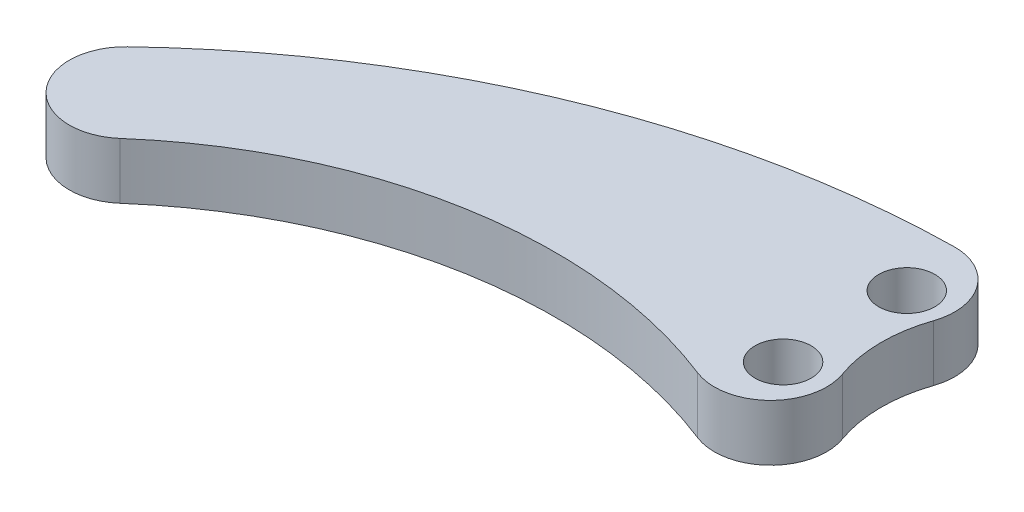
ISO-10303-21;
HEADER;
FILE_DESCRIPTION(('STEP AP214'),'2;1');
FILE_NAME('part.step','',(''),(''),'','','');
FILE_SCHEMA(('AUTOMOTIVE_DESIGN { 1 0 10303 214 1 1 1 1 }'));
ENDSEC;
DATA;
#1=APPLICATION_CONTEXT('core data for automotive mechanical design processes');
#2=APPLICATION_PROTOCOL_DEFINITION('international standard','automotive_design',2000,#1);
#3=PRODUCT_CONTEXT('',#1,'mechanical');
#4=PRODUCT('Part','Part','',(#3));
#5=PRODUCT_RELATED_PRODUCT_CATEGORY('part','',(#4));
#6=PRODUCT_DEFINITION_FORMATION('','',#4);
#7=PRODUCT_DEFINITION_CONTEXT('part definition',#1,'design');
#8=PRODUCT_DEFINITION('design','',#6,#7);
#9=PRODUCT_DEFINITION_SHAPE('','',#8);
#10=(LENGTH_UNIT() NAMED_UNIT(*) SI_UNIT(.MILLI.,.METRE.));
#11=(NAMED_UNIT(*) PLANE_ANGLE_UNIT() SI_UNIT($,.RADIAN.));
#12=(NAMED_UNIT(*) SI_UNIT($,.STERADIAN.) SOLID_ANGLE_UNIT());
#13=UNCERTAINTY_MEASURE_WITH_UNIT(LENGTH_MEASURE(1.E-05),#10,'distance_accuracy_value','');
#14=(GEOMETRIC_REPRESENTATION_CONTEXT(3) GLOBAL_UNCERTAINTY_ASSIGNED_CONTEXT((#13)) GLOBAL_UNIT_ASSIGNED_CONTEXT((#10,
#11,#12)) REPRESENTATION_CONTEXT('',''));
#15=CARTESIAN_POINT('',(0.,0.,0.));
#16=DIRECTION('',(0.,0.,1.));
#17=DIRECTION('',(1.,0.,0.));
#18=AXIS2_PLACEMENT_3D('',#15,#16,#17);
#19=CARTESIAN_POINT('',(-68.570576814493,10.,52.8858262317222));
#20=DIRECTION('',(0.,1.,0.));
#21=DIRECTION('',(0.,0.,1.));
#22=AXIS2_PLACEMENT_3D('',#19,#20,#21);
#23=PLANE('',#22);
#24=CARTESIAN_POINT('',(0.,10.,-22.));
#25=DIRECTION('',(0.,1.,0.));
#26=DIRECTION('',(0.,0.,1.));
#27=AXIS2_PLACEMENT_3D('',#24,#25,#26);
#28=CIRCLE('',#27,5.);
#29=CARTESIAN_POINT('',(0.,10.,-17.));
#30=VERTEX_POINT('',#29);
#31=EDGE_CURVE('E180',#30,#30,#28,.T.);
#32=ORIENTED_EDGE('',*,*,#31,.F.);
#33=EDGE_LOOP('',(#32));
#34=FACE_BOUND('',#33,.T.);
#35=CARTESIAN_POINT('',(-37.1411536289861,10.,88.7716524634445));
#36=DIRECTION('',(0.,-1.,0.));
#37=DIRECTION('',(0.,0.,-1.));
#38=AXIS2_PLACEMENT_3D('',#35,#36,#37);
#39=CIRCLE('',#38,85.4065231754527);
#40=CARTESIAN_POINT('',(-93.4114728973598,10.,24.522719629082));
#41=VERTEX_POINT('',#40);
#42=CARTESIAN_POINT('',(-5.92305827580545,10.,9.27508194974962));
#43=VERTEX_POINT('',#42);
#44=EDGE_CURVE('E129',#41,#43,#39,.T.);
#45=ORIENTED_EDGE('',*,*,#44,.T.);
#46=CARTESIAN_POINT('',(-2.26782279817705,10.,-0.0329389786264418));
#47=DIRECTION('',(0.,1.,0.));
#48=DIRECTION('',(0.,0.,1.));
#49=AXIS2_PLACEMENT_3D('',#46,#47,#48);
#50=CIRCLE('',#49,10.);
#51=CARTESIAN_POINT('',(7.14785483890656,10.,-3.40117510967836));
#52=VERTEX_POINT('',#51);
#53=EDGE_CURVE('E83',#43,#52,#50,.T.);
#54=ORIENTED_EDGE('',*,*,#53,.T.);
#55=CARTESIAN_POINT('',(30.5035185393833,10.,-11.7561117773072));
#56=DIRECTION('',(0.,-1.,0.));
#57=DIRECTION('',(0.,0.,-1.));
#58=AXIS2_PLACEMENT_3D('',#55,#56,#57);
#59=CIRCLE('',#58,24.8050799960382);
#60=CARTESIAN_POINT('',(7.02346655755829,10.,-19.7548087049731));
#61=VERTEX_POINT('',#60);
#62=EDGE_CURVE('E136',#52,#61,#59,.T.);
#63=ORIENTED_EDGE('',*,*,#62,.T.);
#64=CARTESIAN_POINT('',(-2.4423573726912,10.,-22.9794291976074));
#65=DIRECTION('',(0.,1.,0.));
#66=DIRECTION('',(0.,0.,1.));
#67=AXIS2_PLACEMENT_3D('',#64,#65,#66);
#68=CIRCLE('',#67,10.);
#69=CARTESIAN_POINT('',(-2.61079581218706,10.,-32.9780105215804));
#70=VERTEX_POINT('',#69);
#71=EDGE_CURVE('E90',#61,#70,#68,.T.);
#72=ORIENTED_EDGE('',*,*,#71,.T.);
#73=CARTESIAN_POINT('',(2.84494650060196E-13,10.,122.000000000001));
#74=DIRECTION('',(0.,-1.,0.));
#75=DIRECTION('',(0.,0.,-1.));
#76=AXIS2_PLACEMENT_3D('',#73,#74,#75);
#77=CIRCLE('',#76,155.000000000001);
#78=CARTESIAN_POINT('',(-106.896551724138,10.,9.75862068965513));
#79=VERTEX_POINT('',#78);
#80=EDGE_CURVE('E141',#79,#70,#77,.T.);
#81=ORIENTED_EDGE('',*,*,#80,.F.);
#82=CARTESIAN_POINT('',(-100.,10.,17.));
#83=DIRECTION('',(0.,1.,0.));
#84=DIRECTION('',(0.,0.,1.));
#85=AXIS2_PLACEMENT_3D('',#82,#83,#84);
#86=CIRCLE('',#85,10.);
#87=EDGE_CURVE('E137',#79,#41,#86,.T.);
#88=ORIENTED_EDGE('',*,*,#87,.T.);
#89=EDGE_LOOP('',(#45,#54,#63,#72,#81,#88));
#90=FACE_BOUND('',#89,.T.);
#91=CARTESIAN_POINT('',(0.,10.,0.));
#92=DIRECTION('',(0.,1.,0.));
#93=DIRECTION('',(0.,0.,1.));
#94=AXIS2_PLACEMENT_3D('',#91,#92,#93);
#95=CIRCLE('',#94,5.);
#96=CARTESIAN_POINT('',(0.,10.,5.));
#97=VERTEX_POINT('',#96);
#98=EDGE_CURVE('E282',#97,#97,#95,.T.);
#99=ORIENTED_EDGE('',*,*,#98,.F.);
#100=EDGE_LOOP('',(#99));
#101=FACE_BOUND('',#100,.T.);
#102=ADVANCED_FACE('F75',(#34,#90,#101),#23,.T.);
#103=CARTESIAN_POINT('',(-68.570576814493,0.,52.8858262317222));
#104=DIRECTION('',(0.,1.,0.));
#105=DIRECTION('',(0.,0.,1.));
#106=AXIS2_PLACEMENT_3D('',#103,#104,#105);
#107=PLANE('',#106);
#108=CARTESIAN_POINT('',(30.5035185393833,0.,-11.7561117773072));
#109=DIRECTION('',(0.,-1.,0.));
#110=DIRECTION('',(0.,0.,-1.));
#111=AXIS2_PLACEMENT_3D('',#108,#109,#110);
#112=CIRCLE('',#111,24.8050799960382);
#113=CARTESIAN_POINT('',(7.14785483890656,0.,-3.40117510967836));
#114=VERTEX_POINT('',#113);
#115=CARTESIAN_POINT('',(7.02346655755829,0.,-19.7548087049731));
#116=VERTEX_POINT('',#115);
#117=EDGE_CURVE('E177',#114,#116,#112,.T.);
#118=ORIENTED_EDGE('',*,*,#117,.F.);
#119=CARTESIAN_POINT('',(-2.26782279817705,0.,-0.0329389786264418));
#120=DIRECTION('',(0.,1.,0.));
#121=DIRECTION('',(0.,0.,1.));
#122=AXIS2_PLACEMENT_3D('',#119,#120,#121);
#123=CIRCLE('',#122,10.);
#124=CARTESIAN_POINT('',(-5.92305827580545,0.,9.27508194974962));
#125=VERTEX_POINT('',#124);
#126=EDGE_CURVE('E160',#114,#125,#123,.F.);
#127=ORIENTED_EDGE('',*,*,#126,.T.);
#128=CARTESIAN_POINT('',(-37.1411536289861,0.,88.7716524634445));
#129=DIRECTION('',(0.,-1.,0.));
#130=DIRECTION('',(0.,0.,-1.));
#131=AXIS2_PLACEMENT_3D('',#128,#129,#130);
#132=CIRCLE('',#131,85.4065231754527);
#133=CARTESIAN_POINT('',(-93.4114728973598,0.,24.522719629082));
#134=VERTEX_POINT('',#133);
#135=EDGE_CURVE('E176',#134,#125,#132,.T.);
#136=ORIENTED_EDGE('',*,*,#135,.F.);
#137=CARTESIAN_POINT('',(-100.,0.,17.));
#138=DIRECTION('',(0.,1.,0.));
#139=DIRECTION('',(0.,0.,1.));
#140=AXIS2_PLACEMENT_3D('',#137,#138,#139);
#141=CIRCLE('',#140,10.);
#142=CARTESIAN_POINT('',(-106.896551724138,0.,9.75862068965513));
#143=VERTEX_POINT('',#142);
#144=EDGE_CURVE('E147',#143,#134,#141,.T.);
#145=ORIENTED_EDGE('',*,*,#144,.F.);
#146=CARTESIAN_POINT('',(2.84494650060196E-13,0.,122.000000000001));
#147=DIRECTION('',(0.,-1.,0.));
#148=DIRECTION('',(0.,0.,-1.));
#149=AXIS2_PLACEMENT_3D('',#146,#147,#148);
#150=CIRCLE('',#149,155.000000000001);
#151=CARTESIAN_POINT('',(-2.61079581218706,0.,-32.9780105215804));
#152=VERTEX_POINT('',#151);
#153=EDGE_CURVE('E143',#143,#152,#150,.T.);
#154=ORIENTED_EDGE('',*,*,#153,.T.);
#155=CARTESIAN_POINT('',(-2.4423573726912,0.,-22.9794291976074));
#156=DIRECTION('',(0.,1.,0.));
#157=DIRECTION('',(0.,0.,1.));
#158=AXIS2_PLACEMENT_3D('',#155,#156,#157);
#159=CIRCLE('',#158,10.);
#160=EDGE_CURVE('E158',#152,#116,#159,.F.);
#161=ORIENTED_EDGE('',*,*,#160,.T.);
#162=EDGE_LOOP('',(#118,#127,#136,#145,#154,#161));
#163=FACE_BOUND('',#162,.T.);
#164=CARTESIAN_POINT('',(0.,0.,-22.));
#165=DIRECTION('',(0.,1.,0.));
#166=DIRECTION('',(0.,0.,1.));
#167=AXIS2_PLACEMENT_3D('',#164,#165,#166);
#168=CIRCLE('',#167,5.);
#169=CARTESIAN_POINT('',(0.,0.,-17.));
#170=VERTEX_POINT('',#169);
#171=EDGE_CURVE('E288',#170,#170,#168,.T.);
#172=ORIENTED_EDGE('',*,*,#171,.T.);
#173=EDGE_LOOP('',(#172));
#174=FACE_BOUND('',#173,.T.);
#175=CARTESIAN_POINT('',(0.,0.,0.));
#176=DIRECTION('',(0.,1.,0.));
#177=DIRECTION('',(0.,0.,1.));
#178=AXIS2_PLACEMENT_3D('',#175,#176,#177);
#179=CIRCLE('',#178,5.);
#180=CARTESIAN_POINT('',(0.,0.,5.));
#181=VERTEX_POINT('',#180);
#182=EDGE_CURVE('E285',#181,#181,#179,.T.);
#183=ORIENTED_EDGE('',*,*,#182,.T.);
#184=EDGE_LOOP('',(#183));
#185=FACE_BOUND('',#184,.T.);
#186=ADVANCED_FACE('F174',(#163,#174,#185),#107,.F.);
#187=CARTESIAN_POINT('',(-100.,10.,17.));
#188=DIRECTION('',(0.,-1.,0.));
#189=DIRECTION('',(0.,0.,-1.));
#190=AXIS2_PLACEMENT_3D('',#187,#188,#189);
#191=CYLINDRICAL_SURFACE('',#190,10.);
#192=ORIENTED_EDGE('',*,*,#144,.T.);
#193=DIRECTION('',(0.,-1.,0.));
#194=VECTOR('',#193,1.);
#195=CARTESIAN_POINT('',(-93.4114728973598,10.,24.522719629082));
#196=LINE('',#195,#194);
#197=EDGE_CURVE('E133',#41,#134,#196,.T.);
#198=ORIENTED_EDGE('',*,*,#197,.F.);
#199=ORIENTED_EDGE('',*,*,#87,.F.);
#200=DIRECTION('',(0.,-1.,0.));
#201=VECTOR('',#200,1.);
#202=CARTESIAN_POINT('',(-106.896551724138,10.,9.75862068965513));
#203=LINE('',#202,#201);
#204=EDGE_CURVE('E149',#79,#143,#203,.T.);
#205=ORIENTED_EDGE('',*,*,#204,.T.);
#206=EDGE_LOOP('',(#192,#198,#199,#205));
#207=FACE_BOUND('',#206,.T.);
#208=ADVANCED_FACE('F145',(#207),#191,.T.);
#209=CARTESIAN_POINT('',(-37.1411536289861,10.,88.7716524634445));
#210=DIRECTION('',(0.,-1.,0.));
#211=DIRECTION('',(0.,0.,-1.));
#212=AXIS2_PLACEMENT_3D('',#209,#210,#211);
#213=CYLINDRICAL_SURFACE('',#212,85.4065231754527);
#214=ORIENTED_EDGE('',*,*,#135,.T.);
#215=DIRECTION('',(0.,-1.,0.));
#216=VECTOR('',#215,1.);
#217=CARTESIAN_POINT('',(-5.92305827580543,10.,9.2750819497496));
#218=LINE('',#217,#216);
#219=EDGE_CURVE('E98',#125,#43,#218,.F.);
#220=ORIENTED_EDGE('',*,*,#219,.T.);
#221=ORIENTED_EDGE('',*,*,#44,.F.);
#222=ORIENTED_EDGE('',*,*,#197,.T.);
#223=EDGE_LOOP('',(#214,#220,#221,#222));
#224=FACE_BOUND('',#223,.T.);
#225=ADVANCED_FACE('F131',(#224),#213,.F.);
#226=CARTESIAN_POINT('',(30.5035185393833,10.,-11.7561117773072));
#227=DIRECTION('',(0.,-1.,0.));
#228=DIRECTION('',(0.,0.,-1.));
#229=AXIS2_PLACEMENT_3D('',#226,#227,#228);
#230=CYLINDRICAL_SURFACE('',#229,24.8050799960382);
#231=ORIENTED_EDGE('',*,*,#62,.F.);
#232=DIRECTION('',(0.,-1.,0.));
#233=VECTOR('',#232,1.);
#234=CARTESIAN_POINT('',(7.14785483890656,10.,-3.40117510967834));
#235=LINE('',#234,#233);
#236=EDGE_CURVE('E151',#52,#114,#235,.T.);
#237=ORIENTED_EDGE('',*,*,#236,.T.);
#238=ORIENTED_EDGE('',*,*,#117,.T.);
#239=DIRECTION('',(0.,-1.,0.));
#240=VECTOR('',#239,1.);
#241=CARTESIAN_POINT('',(7.02346655755828,10.,-19.7548087049731));
#242=LINE('',#241,#240);
#243=EDGE_CURVE('E148',#116,#61,#242,.F.);
#244=ORIENTED_EDGE('',*,*,#243,.T.);
#245=EDGE_LOOP('',(#231,#237,#238,#244));
#246=FACE_BOUND('',#245,.T.);
#247=ADVANCED_FACE('F167',(#246),#230,.F.);
#248=CARTESIAN_POINT('',(2.84494650060196E-13,10.,122.000000000001));
#249=DIRECTION('',(0.,-1.,0.));
#250=DIRECTION('',(0.,0.,-1.));
#251=AXIS2_PLACEMENT_3D('',#248,#249,#250);
#252=CYLINDRICAL_SURFACE('',#251,155.000000000001);
#253=ORIENTED_EDGE('',*,*,#80,.T.);
#254=DIRECTION('',(0.,-1.,0.));
#255=VECTOR('',#254,1.);
#256=CARTESIAN_POINT('',(-2.61079581218716,10.,-32.9780105215804));
#257=LINE('',#256,#255);
#258=EDGE_CURVE('E12',#70,#152,#257,.T.);
#259=ORIENTED_EDGE('',*,*,#258,.T.);
#260=ORIENTED_EDGE('',*,*,#153,.F.);
#261=ORIENTED_EDGE('',*,*,#204,.F.);
#262=EDGE_LOOP('',(#253,#259,#260,#261));
#263=FACE_BOUND('',#262,.T.);
#264=ADVANCED_FACE('F186',(#263),#252,.T.);
#265=CARTESIAN_POINT('',(0.,10.,-22.));
#266=DIRECTION('',(0.,-1.,0.));
#267=DIRECTION('',(0.,0.,-1.));
#268=AXIS2_PLACEMENT_3D('',#265,#266,#267);
#269=CYLINDRICAL_SURFACE('',#268,5.);
#270=ORIENTED_EDGE('',*,*,#31,.T.);
#271=EDGE_LOOP('',(#270));
#272=FACE_BOUND('',#271,.T.);
#273=ORIENTED_EDGE('',*,*,#171,.F.);
#274=EDGE_LOOP('',(#273));
#275=FACE_BOUND('',#274,.T.);
#276=ADVANCED_FACE('F203',(#272,#275),#269,.F.);
#277=CARTESIAN_POINT('',(0.,10.,0.));
#278=DIRECTION('',(0.,-1.,0.));
#279=DIRECTION('',(0.,0.,-1.));
#280=AXIS2_PLACEMENT_3D('',#277,#278,#279);
#281=CYLINDRICAL_SURFACE('',#280,5.);
#282=ORIENTED_EDGE('',*,*,#98,.T.);
#283=EDGE_LOOP('',(#282));
#284=FACE_BOUND('',#283,.T.);
#285=ORIENTED_EDGE('',*,*,#182,.F.);
#286=EDGE_LOOP('',(#285));
#287=FACE_BOUND('',#286,.T.);
#288=ADVANCED_FACE('F193',(#284,#287),#281,.F.);
#289=CARTESIAN_POINT('',(-2.26782279817705,10.,-0.0329389786264418));
#290=DIRECTION('',(0.,-1.,0.));
#291=DIRECTION('',(0.,0.,-1.));
#292=AXIS2_PLACEMENT_3D('',#289,#290,#291);
#293=CYLINDRICAL_SURFACE('',#292,10.);
#294=ORIENTED_EDGE('',*,*,#53,.F.);
#295=ORIENTED_EDGE('',*,*,#219,.F.);
#296=ORIENTED_EDGE('',*,*,#126,.F.);
#297=ORIENTED_EDGE('',*,*,#236,.F.);
#298=EDGE_LOOP('',(#294,#295,#296,#297));
#299=FACE_BOUND('',#298,.T.);
#300=ADVANCED_FACE('F172',(#299),#293,.T.);
#301=CARTESIAN_POINT('',(-2.4423573726912,10.,-22.9794291976074));
#302=DIRECTION('',(0.,1.,0.));
#303=DIRECTION('',(0.,0.,1.));
#304=AXIS2_PLACEMENT_3D('',#301,#302,#303);
#305=CYLINDRICAL_SURFACE('',#304,10.);
#306=ORIENTED_EDGE('',*,*,#71,.F.);
#307=ORIENTED_EDGE('',*,*,#243,.F.);
#308=ORIENTED_EDGE('',*,*,#160,.F.);
#309=ORIENTED_EDGE('',*,*,#258,.F.);
#310=EDGE_LOOP('',(#306,#307,#308,#309));
#311=FACE_BOUND('',#310,.T.);
#312=ADVANCED_FACE('F77',(#311),#305,.T.);
#313=CLOSED_SHELL('',(#102,#186,#208,#225,#247,#264,#276,#288,#300,#312));
#314=MANIFOLD_SOLID_BREP('B2',#313);
#315=ADVANCED_BREP_SHAPE_REPRESENTATION('',(#18,#314),#14);
#316=SHAPE_DEFINITION_REPRESENTATION(#9,#315);
ENDSEC;
END-ISO-10303-21;
